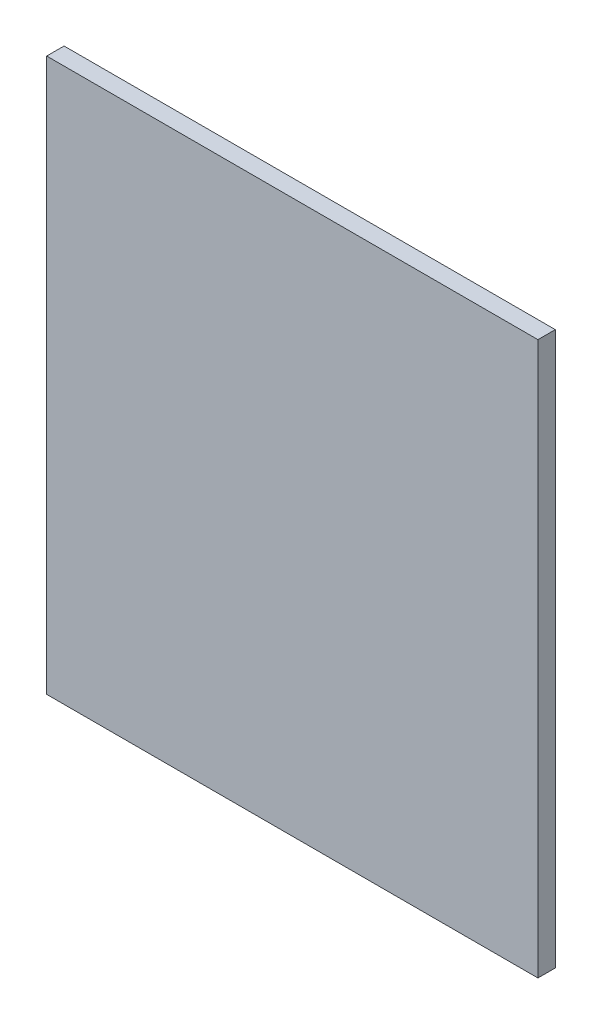
ISO-10303-21;
HEADER;
FILE_DESCRIPTION(('STEP AP214'),'2;1');
FILE_NAME('part.step','',(''),(''),'','','');
FILE_SCHEMA(('AUTOMOTIVE_DESIGN { 1 0 10303 214 1 1 1 1 }'));
ENDSEC;
DATA;
#1=APPLICATION_CONTEXT('core data for automotive mechanical design processes');
#2=APPLICATION_PROTOCOL_DEFINITION('international standard','automotive_design',2000,#1);
#3=PRODUCT_CONTEXT('',#1,'mechanical');
#4=PRODUCT('Part','Part','',(#3));
#5=PRODUCT_RELATED_PRODUCT_CATEGORY('part','',(#4));
#6=PRODUCT_DEFINITION_FORMATION('','',#4);
#7=PRODUCT_DEFINITION_CONTEXT('part definition',#1,'design');
#8=PRODUCT_DEFINITION('design','',#6,#7);
#9=PRODUCT_DEFINITION_SHAPE('','',#8);
#10=(LENGTH_UNIT() NAMED_UNIT(*) SI_UNIT(.MILLI.,.METRE.));
#11=(NAMED_UNIT(*) PLANE_ANGLE_UNIT() SI_UNIT($,.RADIAN.));
#12=(NAMED_UNIT(*) SI_UNIT($,.STERADIAN.) SOLID_ANGLE_UNIT());
#13=UNCERTAINTY_MEASURE_WITH_UNIT(LENGTH_MEASURE(1.E-05),#10,'distance_accuracy_value','');
#14=(GEOMETRIC_REPRESENTATION_CONTEXT(3) GLOBAL_UNCERTAINTY_ASSIGNED_CONTEXT((#13)) GLOBAL_UNIT_ASSIGNED_CONTEXT((#10,
#11,#12)) REPRESENTATION_CONTEXT('',''));
#15=CARTESIAN_POINT('',(0.,0.,0.));
#16=DIRECTION('',(0.,0.,1.));
#17=DIRECTION('',(1.,0.,0.));
#18=AXIS2_PLACEMENT_3D('',#15,#16,#17);
#19=CARTESIAN_POINT('',(0.,88.9,0.));
#20=DIRECTION('',(1.,0.,0.));
#21=DIRECTION('',(0.,0.,-1.));
#22=AXIS2_PLACEMENT_3D('',#19,#20,#21);
#23=PLANE('',#22);
#24=DIRECTION('',(0.,0.,1.));
#25=VECTOR('',#24,1.);
#26=CARTESIAN_POINT('',(0.,0.,0.));
#27=LINE('',#26,#25);
#28=CARTESIAN_POINT('',(0.,0.,-2.79399999999999));
#29=VERTEX_POINT('',#28);
#30=CARTESIAN_POINT('',(0.,0.,0.));
#31=VERTEX_POINT('',#30);
#32=EDGE_CURVE('E100',#29,#31,#27,.T.);
#33=ORIENTED_EDGE('',*,*,#32,.T.);
#34=DIRECTION('',(0.,-1.,0.));
#35=VECTOR('',#34,1.);
#36=CARTESIAN_POINT('',(0.,88.9,0.));
#37=LINE('',#36,#35);
#38=CARTESIAN_POINT('',(0.,88.9,0.));
#39=VERTEX_POINT('',#38);
#40=EDGE_CURVE('E11',#39,#31,#37,.T.);
#41=ORIENTED_EDGE('',*,*,#40,.F.);
#42=DIRECTION('',(0.,0.,1.));
#43=VECTOR('',#42,1.);
#44=CARTESIAN_POINT('',(0.,88.9,0.));
#45=LINE('',#44,#43);
#46=CARTESIAN_POINT('',(0.,88.9,-2.79399999999999));
#47=VERTEX_POINT('',#46);
#48=EDGE_CURVE('E88',#47,#39,#45,.T.);
#49=ORIENTED_EDGE('',*,*,#48,.F.);
#50=DIRECTION('',(0.,-1.,0.));
#51=VECTOR('',#50,1.);
#52=CARTESIAN_POINT('',(0.,88.9,-2.79399999999999));
#53=LINE('',#52,#51);
#54=EDGE_CURVE('E96',#47,#29,#53,.T.);
#55=ORIENTED_EDGE('',*,*,#54,.T.);
#56=EDGE_LOOP('',(#33,#41,#49,#55));
#57=FACE_BOUND('',#56,.T.);
#58=ADVANCED_FACE('F37',(#57),#23,.F.);
#59=CARTESIAN_POINT('',(0.,88.9,0.));
#60=DIRECTION('',(0.,0.,-1.));
#61=DIRECTION('',(-1.,0.,0.));
#62=AXIS2_PLACEMENT_3D('',#59,#60,#61);
#63=PLANE('',#62);
#64=DIRECTION('',(1.,0.,0.));
#65=VECTOR('',#64,1.);
#66=CARTESIAN_POINT('',(0.,0.,0.));
#67=LINE('',#66,#65);
#68=CARTESIAN_POINT('',(78.994,0.,0.));
#69=VERTEX_POINT('',#68);
#70=EDGE_CURVE('E92',#31,#69,#67,.T.);
#71=ORIENTED_EDGE('',*,*,#70,.T.);
#72=DIRECTION('',(0.,-1.,0.));
#73=VECTOR('',#72,1.);
#74=CARTESIAN_POINT('',(78.994,88.9,0.));
#75=LINE('',#74,#73);
#76=CARTESIAN_POINT('',(78.994,88.9,0.));
#77=VERTEX_POINT('',#76);
#78=EDGE_CURVE('E45',#77,#69,#75,.T.);
#79=ORIENTED_EDGE('',*,*,#78,.F.);
#80=DIRECTION('',(1.,0.,0.));
#81=VECTOR('',#80,1.);
#82=CARTESIAN_POINT('',(0.,88.9,0.));
#83=LINE('',#82,#81);
#84=EDGE_CURVE('E83',#39,#77,#83,.T.);
#85=ORIENTED_EDGE('',*,*,#84,.F.);
#86=ORIENTED_EDGE('',*,*,#40,.T.);
#87=EDGE_LOOP('',(#71,#79,#85,#86));
#88=FACE_BOUND('',#87,.T.);
#89=ADVANCED_FACE('F91',(#88),#63,.F.);
#90=CARTESIAN_POINT('',(78.994,88.9,0.));
#91=DIRECTION('',(-1.,0.,0.));
#92=DIRECTION('',(0.,0.,1.));
#93=AXIS2_PLACEMENT_3D('',#90,#91,#92);
#94=PLANE('',#93);
#95=DIRECTION('',(0.,0.,-1.));
#96=VECTOR('',#95,1.);
#97=CARTESIAN_POINT('',(78.994,0.,0.));
#98=LINE('',#97,#96);
#99=CARTESIAN_POINT('',(78.994,0.,-2.794));
#100=VERTEX_POINT('',#99);
#101=EDGE_CURVE('E70',#69,#100,#98,.T.);
#102=ORIENTED_EDGE('',*,*,#101,.T.);
#103=DIRECTION('',(0.,-1.,0.));
#104=VECTOR('',#103,1.);
#105=CARTESIAN_POINT('',(78.994,88.9,-2.794));
#106=LINE('',#105,#104);
#107=CARTESIAN_POINT('',(78.994,88.9,-2.794));
#108=VERTEX_POINT('',#107);
#109=EDGE_CURVE('E93',#108,#100,#106,.T.);
#110=ORIENTED_EDGE('',*,*,#109,.F.);
#111=DIRECTION('',(0.,0.,-1.));
#112=VECTOR('',#111,1.);
#113=CARTESIAN_POINT('',(78.994,88.9,0.));
#114=LINE('',#113,#112);
#115=EDGE_CURVE('E86',#77,#108,#114,.T.);
#116=ORIENTED_EDGE('',*,*,#115,.F.);
#117=ORIENTED_EDGE('',*,*,#78,.T.);
#118=EDGE_LOOP('',(#102,#110,#116,#117));
#119=FACE_BOUND('',#118,.T.);
#120=ADVANCED_FACE('F94',(#119),#94,.F.);
#121=CARTESIAN_POINT('',(0.,88.9,-2.79399999999999));
#122=DIRECTION('',(0.,0.,1.));
#123=DIRECTION('',(1.,0.,0.));
#124=AXIS2_PLACEMENT_3D('',#121,#122,#123);
#125=PLANE('',#124);
#126=DIRECTION('',(-1.,0.,0.));
#127=VECTOR('',#126,1.);
#128=CARTESIAN_POINT('',(0.,0.,-2.79399999999999));
#129=LINE('',#128,#127);
#130=EDGE_CURVE('E76',#100,#29,#129,.T.);
#131=ORIENTED_EDGE('',*,*,#130,.T.);
#132=ORIENTED_EDGE('',*,*,#54,.F.);
#133=DIRECTION('',(-1.,0.,0.));
#134=VECTOR('',#133,1.);
#135=CARTESIAN_POINT('',(0.,88.9,-2.79399999999999));
#136=LINE('',#135,#134);
#137=EDGE_CURVE('E53',#108,#47,#136,.T.);
#138=ORIENTED_EDGE('',*,*,#137,.F.);
#139=ORIENTED_EDGE('',*,*,#109,.T.);
#140=EDGE_LOOP('',(#131,#132,#138,#139));
#141=FACE_BOUND('',#140,.T.);
#142=ADVANCED_FACE('F107',(#141),#125,.F.);
#143=CARTESIAN_POINT('',(0.,88.9,0.));
#144=DIRECTION('',(0.,-1.,0.));
#145=DIRECTION('',(0.,0.,-1.));
#146=AXIS2_PLACEMENT_3D('',#143,#144,#145);
#147=PLANE('',#146);
#148=ORIENTED_EDGE('',*,*,#48,.T.);
#149=ORIENTED_EDGE('',*,*,#84,.T.);
#150=ORIENTED_EDGE('',*,*,#115,.T.);
#151=ORIENTED_EDGE('',*,*,#137,.T.);
#152=EDGE_LOOP('',(#148,#149,#150,#151));
#153=FACE_BOUND('',#152,.T.);
#154=ADVANCED_FACE('F84',(#153),#147,.F.);
#155=CARTESIAN_POINT('',(0.,0.,0.));
#156=DIRECTION('',(0.,-1.,0.));
#157=DIRECTION('',(0.,0.,-1.));
#158=AXIS2_PLACEMENT_3D('',#155,#156,#157);
#159=PLANE('',#158);
#160=ORIENTED_EDGE('',*,*,#32,.F.);
#161=ORIENTED_EDGE('',*,*,#130,.F.);
#162=ORIENTED_EDGE('',*,*,#101,.F.);
#163=ORIENTED_EDGE('',*,*,#70,.F.);
#164=EDGE_LOOP('',(#160,#161,#162,#163));
#165=FACE_BOUND('',#164,.T.);
#166=ADVANCED_FACE('F110',(#165),#159,.T.);
#167=CLOSED_SHELL('',(#58,#89,#120,#142,#154,#166));
#168=MANIFOLD_SOLID_BREP('B2',#167);
#169=ADVANCED_BREP_SHAPE_REPRESENTATION('',(#18,#168),#14);
#170=SHAPE_DEFINITION_REPRESENTATION(#9,#169);
ENDSEC;
END-ISO-10303-21;
